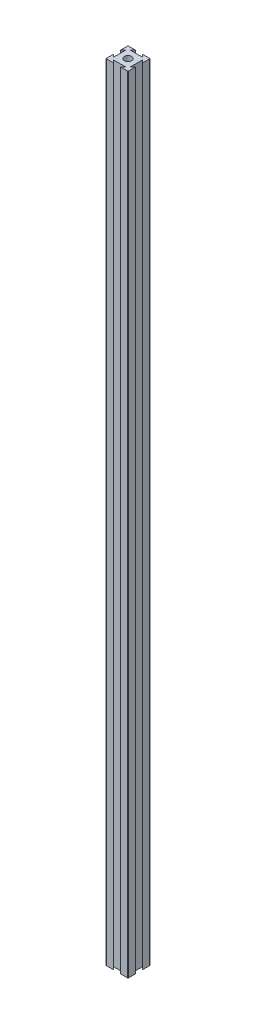
ISO-10303-21;
HEADER;
FILE_DESCRIPTION(('STEP AP214'),'2;1');
FILE_NAME('part.step','',(''),(''),'','','');
FILE_SCHEMA(('AUTOMOTIVE_DESIGN { 1 0 10303 214 1 1 1 1 }'));
ENDSEC;
DATA;
#1=APPLICATION_CONTEXT('core data for automotive mechanical design processes');
#2=APPLICATION_PROTOCOL_DEFINITION('international standard','automotive_design',2000,#1);
#3=PRODUCT_CONTEXT('',#1,'mechanical');
#4=PRODUCT('Part','Part','',(#3));
#5=PRODUCT_RELATED_PRODUCT_CATEGORY('part','',(#4));
#6=PRODUCT_DEFINITION_FORMATION('','',#4);
#7=PRODUCT_DEFINITION_CONTEXT('part definition',#1,'design');
#8=PRODUCT_DEFINITION('design','',#6,#7);
#9=PRODUCT_DEFINITION_SHAPE('','',#8);
#10=(LENGTH_UNIT() NAMED_UNIT(*) SI_UNIT(.MILLI.,.METRE.));
#11=(NAMED_UNIT(*) PLANE_ANGLE_UNIT() SI_UNIT($,.RADIAN.));
#12=(NAMED_UNIT(*) SI_UNIT($,.STERADIAN.) SOLID_ANGLE_UNIT());
#13=UNCERTAINTY_MEASURE_WITH_UNIT(LENGTH_MEASURE(1.E-05),#10,'distance_accuracy_value','');
#14=(GEOMETRIC_REPRESENTATION_CONTEXT(3) GLOBAL_UNCERTAINTY_ASSIGNED_CONTEXT((#13)) GLOBAL_UNIT_ASSIGNED_CONTEXT((#10,
#11,#12)) REPRESENTATION_CONTEXT('',''));
#15=CARTESIAN_POINT('',(0.,0.,0.));
#16=DIRECTION('',(0.,0.,1.));
#17=DIRECTION('',(1.,0.,0.));
#18=AXIS2_PLACEMENT_3D('',#15,#16,#17);
#19=CARTESIAN_POINT('',(16.6666666666667,711.2,-16.6666666666667));
#20=DIRECTION('',(-0.707106781186547,0.,0.707106781186548));
#21=DIRECTION('',(0.707106781186548,0.,0.707106781186547));
#22=AXIS2_PLACEMENT_3D('',#19,#20,#21);
#23=PLANE('',#22);
#24=DIRECTION('',(-0.707106781186548,0.,-0.707106781186547));
#25=VECTOR('',#24,1.);
#26=CARTESIAN_POINT('',(16.6666666666667,0.,-16.6666666666667));
#27=LINE('',#26,#25);
#28=CARTESIAN_POINT('',(20.,0.,-13.3333333333333));
#29=VERTEX_POINT('',#28);
#30=CARTESIAN_POINT('',(17.6183333333333,0.,-15.715));
#31=VERTEX_POINT('',#30);
#32=EDGE_CURVE('E201',#29,#31,#27,.T.);
#33=ORIENTED_EDGE('',*,*,#32,.F.);
#34=DIRECTION('',(0.,-1.,0.));
#35=VECTOR('',#34,1.);
#36=CARTESIAN_POINT('',(20.,711.2,-13.3333333333333));
#37=LINE('',#36,#35);
#38=CARTESIAN_POINT('',(20.,711.2,-13.3333333333333));
#39=VERTEX_POINT('',#38);
#40=EDGE_CURVE('E195',#39,#29,#37,.T.);
#41=ORIENTED_EDGE('',*,*,#40,.F.);
#42=DIRECTION('',(-0.707106781186548,0.,-0.707106781186547));
#43=VECTOR('',#42,1.);
#44=CARTESIAN_POINT('',(16.6666666666667,711.2,-16.6666666666667));
#45=LINE('',#44,#43);
#46=CARTESIAN_POINT('',(17.6183333333333,711.2,-15.715));
#47=VERTEX_POINT('',#46);
#48=EDGE_CURVE('E198',#39,#47,#45,.T.);
#49=ORIENTED_EDGE('',*,*,#48,.T.);
#50=DIRECTION('',(0.,-1.,0.));
#51=VECTOR('',#50,1.);
#52=CARTESIAN_POINT('',(17.6183333333333,711.2,-15.715));
#53=LINE('',#52,#51);
#54=EDGE_CURVE('E269',#47,#31,#53,.T.);
#55=ORIENTED_EDGE('',*,*,#54,.T.);
#56=EDGE_LOOP('',(#33,#41,#49,#55));
#57=FACE_BOUND('',#56,.T.);
#58=ADVANCED_FACE('F35',(#57),#23,.T.);
#59=CARTESIAN_POINT('',(20.,711.2,0.));
#60=DIRECTION('',(-1.,0.,0.));
#61=DIRECTION('',(0.,0.,1.));
#62=AXIS2_PLACEMENT_3D('',#59,#60,#61);
#63=PLANE('',#62);
#64=DIRECTION('',(0.,0.,-1.));
#65=VECTOR('',#64,1.);
#66=CARTESIAN_POINT('',(20.,0.,0.));
#67=LINE('',#66,#65);
#68=CARTESIAN_POINT('',(20.,0.,-19.492));
#69=VERTEX_POINT('',#68);
#70=EDGE_CURVE('E274',#29,#69,#67,.T.);
#71=ORIENTED_EDGE('',*,*,#70,.T.);
#72=DIRECTION('',(0.,-1.,0.));
#73=VECTOR('',#72,1.);
#74=CARTESIAN_POINT('',(20.,711.2,-19.492));
#75=LINE('',#74,#73);
#76=CARTESIAN_POINT('',(20.,711.2,-19.492));
#77=VERTEX_POINT('',#76);
#78=EDGE_CURVE('E212',#69,#77,#75,.F.);
#79=ORIENTED_EDGE('',*,*,#78,.T.);
#80=DIRECTION('',(0.,0.,-1.));
#81=VECTOR('',#80,1.);
#82=CARTESIAN_POINT('',(20.,711.2,0.));
#83=LINE('',#82,#81);
#84=EDGE_CURVE('E209',#39,#77,#83,.T.);
#85=ORIENTED_EDGE('',*,*,#84,.F.);
#86=ORIENTED_EDGE('',*,*,#40,.T.);
#87=EDGE_LOOP('',(#71,#79,#85,#86));
#88=FACE_BOUND('',#87,.T.);
#89=ADVANCED_FACE('F210',(#88),#63,.F.);
#90=CARTESIAN_POINT('',(0.,711.2,-20.));
#91=DIRECTION('',(0.,0.,-1.));
#92=DIRECTION('',(-1.,0.,0.));
#93=AXIS2_PLACEMENT_3D('',#90,#91,#92);
#94=PLANE('',#93);
#95=DIRECTION('',(1.,0.,0.));
#96=VECTOR('',#95,1.);
#97=CARTESIAN_POINT('',(0.,711.2,-20.));
#98=LINE('',#97,#96);
#99=CARTESIAN_POINT('',(13.3333333333333,711.2,-20.));
#100=VERTEX_POINT('',#99);
#101=CARTESIAN_POINT('',(19.492,711.2,-20.));
#102=VERTEX_POINT('',#101);
#103=EDGE_CURVE('E214',#100,#102,#98,.T.);
#104=ORIENTED_EDGE('',*,*,#103,.T.);
#105=DIRECTION('',(0.,-1.,0.));
#106=VECTOR('',#105,1.);
#107=CARTESIAN_POINT('',(19.492,0.,-20.));
#108=LINE('',#107,#106);
#109=CARTESIAN_POINT('',(19.492,0.,-20.));
#110=VERTEX_POINT('',#109);
#111=EDGE_CURVE('E376',#102,#110,#108,.T.);
#112=ORIENTED_EDGE('',*,*,#111,.T.);
#113=DIRECTION('',(1.,0.,0.));
#114=VECTOR('',#113,1.);
#115=CARTESIAN_POINT('',(0.,0.,-20.));
#116=LINE('',#115,#114);
#117=CARTESIAN_POINT('',(13.3333333333333,0.,-20.));
#118=VERTEX_POINT('',#117);
#119=EDGE_CURVE('E276',#118,#110,#116,.T.);
#120=ORIENTED_EDGE('',*,*,#119,.F.);
#121=DIRECTION('',(0.,-1.,0.));
#122=VECTOR('',#121,1.);
#123=CARTESIAN_POINT('',(13.3333333333333,711.2,-20.));
#124=LINE('',#123,#122);
#125=EDGE_CURVE('E206',#100,#118,#124,.T.);
#126=ORIENTED_EDGE('',*,*,#125,.F.);
#127=EDGE_LOOP('',(#104,#112,#120,#126));
#128=FACE_BOUND('',#127,.T.);
#129=ADVANCED_FACE('F408',(#128),#94,.T.);
#130=CARTESIAN_POINT('',(16.6666666666666,711.2,-16.6666666666668));
#131=DIRECTION('',(-0.707106781186544,0.,0.707106781186551));
#132=DIRECTION('',(0.707106781186551,0.,0.707106781186544));
#133=AXIS2_PLACEMENT_3D('',#130,#131,#132);
#134=PLANE('',#133);
#135=DIRECTION('',(-0.707106781186551,0.,-0.707106781186544));
#136=VECTOR('',#135,1.);
#137=CARTESIAN_POINT('',(16.6666666666666,0.,-16.6666666666668));
#138=LINE('',#137,#136);
#139=CARTESIAN_POINT('',(15.715,0.,-17.6183333333334));
#140=VERTEX_POINT('',#139);
#141=EDGE_CURVE('E280',#140,#118,#138,.T.);
#142=ORIENTED_EDGE('',*,*,#141,.F.);
#143=DIRECTION('',(0.,-1.,0.));
#144=VECTOR('',#143,1.);
#145=CARTESIAN_POINT('',(15.715,711.2,-17.6183333333334));
#146=LINE('',#145,#144);
#147=CARTESIAN_POINT('',(15.715,711.2,-17.6183333333334));
#148=VERTEX_POINT('',#147);
#149=EDGE_CURVE('E354',#148,#140,#146,.T.);
#150=ORIENTED_EDGE('',*,*,#149,.F.);
#151=DIRECTION('',(-0.707106781186551,0.,-0.707106781186544));
#152=VECTOR('',#151,1.);
#153=CARTESIAN_POINT('',(16.6666666666666,711.2,-16.6666666666668));
#154=LINE('',#153,#152);
#155=EDGE_CURVE('E230',#148,#100,#154,.T.);
#156=ORIENTED_EDGE('',*,*,#155,.T.);
#157=ORIENTED_EDGE('',*,*,#125,.T.);
#158=EDGE_LOOP('',(#142,#150,#156,#157));
#159=FACE_BOUND('',#158,.T.);
#160=ADVANCED_FACE('F412',(#159),#134,.T.);
#161=CARTESIAN_POINT('',(0.,711.2,-17.6183333333334));
#162=DIRECTION('',(0.,0.,-1.));
#163=DIRECTION('',(-1.,0.,0.));
#164=AXIS2_PLACEMENT_3D('',#161,#162,#163);
#165=PLANE('',#164);
#166=DIRECTION('',(1.,0.,0.));
#167=VECTOR('',#166,1.);
#168=CARTESIAN_POINT('',(0.,0.,-17.6183333333334));
#169=LINE('',#168,#167);
#170=CARTESIAN_POINT('',(4.285,0.,-17.6183333333334));
#171=VERTEX_POINT('',#170);
#172=EDGE_CURVE('E284',#171,#140,#169,.T.);
#173=ORIENTED_EDGE('',*,*,#172,.F.);
#174=DIRECTION('',(0.,-1.,0.));
#175=VECTOR('',#174,1.);
#176=CARTESIAN_POINT('',(4.285,711.2,-17.6183333333334));
#177=LINE('',#176,#175);
#178=CARTESIAN_POINT('',(4.285,711.2,-17.6183333333334));
#179=VERTEX_POINT('',#178);
#180=EDGE_CURVE('E352',#179,#171,#177,.T.);
#181=ORIENTED_EDGE('',*,*,#180,.F.);
#182=DIRECTION('',(1.,0.,0.));
#183=VECTOR('',#182,1.);
#184=CARTESIAN_POINT('',(0.,711.2,-17.6183333333334));
#185=LINE('',#184,#183);
#186=EDGE_CURVE('E234',#179,#148,#185,.T.);
#187=ORIENTED_EDGE('',*,*,#186,.T.);
#188=ORIENTED_EDGE('',*,*,#149,.T.);
#189=EDGE_LOOP('',(#173,#181,#187,#188));
#190=FACE_BOUND('',#189,.T.);
#191=ADVANCED_FACE('F439',(#190),#165,.T.);
#192=CARTESIAN_POINT('',(-6.6666666666667,711.2,-6.66666666666677));
#193=DIRECTION('',(0.707106781186544,0.,0.707106781186551));
#194=DIRECTION('',(0.707106781186551,0.,-0.707106781186544));
#195=AXIS2_PLACEMENT_3D('',#192,#193,#194);
#196=PLANE('',#195);
#197=DIRECTION('',(-0.707106781186551,0.,0.707106781186544));
#198=VECTOR('',#197,1.);
#199=CARTESIAN_POINT('',(-6.6666666666667,0.,-6.66666666666677));
#200=LINE('',#199,#198);
#201=CARTESIAN_POINT('',(6.66666666666666,0.,-20.));
#202=VERTEX_POINT('',#201);
#203=EDGE_CURVE('E287',#202,#171,#200,.T.);
#204=ORIENTED_EDGE('',*,*,#203,.F.);
#205=DIRECTION('',(0.,-1.,0.));
#206=VECTOR('',#205,1.);
#207=CARTESIAN_POINT('',(6.66666666666666,711.2,-20.));
#208=LINE('',#207,#206);
#209=CARTESIAN_POINT('',(6.66666666666666,711.2,-20.));
#210=VERTEX_POINT('',#209);
#211=EDGE_CURVE('E349',#210,#202,#208,.T.);
#212=ORIENTED_EDGE('',*,*,#211,.F.);
#213=DIRECTION('',(-0.707106781186551,0.,0.707106781186544));
#214=VECTOR('',#213,1.);
#215=CARTESIAN_POINT('',(-6.6666666666667,711.2,-6.66666666666677));
#216=LINE('',#215,#214);
#217=EDGE_CURVE('E237',#210,#179,#216,.T.);
#218=ORIENTED_EDGE('',*,*,#217,.T.);
#219=ORIENTED_EDGE('',*,*,#180,.T.);
#220=EDGE_LOOP('',(#204,#212,#218,#219));
#221=FACE_BOUND('',#220,.T.);
#222=ADVANCED_FACE('F442',(#221),#196,.T.);
#223=CARTESIAN_POINT('',(0.508,0.,-20.));
#224=VERTEX_POINT('',#223);
#225=EDGE_CURVE('E281',#224,#202,#116,.T.);
#226=ORIENTED_EDGE('',*,*,#225,.F.);
#227=DIRECTION('',(0.,-1.,0.));
#228=VECTOR('',#227,1.);
#229=CARTESIAN_POINT('',(0.508,711.2,-20.));
#230=LINE('',#229,#228);
#231=CARTESIAN_POINT('',(0.508,711.2,-20.));
#232=VERTEX_POINT('',#231);
#233=EDGE_CURVE('E367',#224,#232,#230,.F.);
#234=ORIENTED_EDGE('',*,*,#233,.T.);
#235=EDGE_CURVE('E231',#232,#210,#98,.T.);
#236=ORIENTED_EDGE('',*,*,#235,.T.);
#237=ORIENTED_EDGE('',*,*,#211,.T.);
#238=EDGE_LOOP('',(#226,#234,#236,#237));
#239=FACE_BOUND('',#238,.T.);
#240=ADVANCED_FACE('F505',(#239),#94,.T.);
#241=CARTESIAN_POINT('',(0.,711.2,0.));
#242=DIRECTION('',(-1.,0.,0.));
#243=DIRECTION('',(0.,0.,1.));
#244=AXIS2_PLACEMENT_3D('',#241,#242,#243);
#245=PLANE('',#244);
#246=DIRECTION('',(0.,0.,-1.));
#247=VECTOR('',#246,1.);
#248=CARTESIAN_POINT('',(0.,711.2,0.));
#249=LINE('',#248,#247);
#250=CARTESIAN_POINT('',(0.,711.2,-13.3333333333333));
#251=VERTEX_POINT('',#250);
#252=CARTESIAN_POINT('',(0.,711.2,-19.492));
#253=VERTEX_POINT('',#252);
#254=EDGE_CURVE('E240',#251,#253,#249,.T.);
#255=ORIENTED_EDGE('',*,*,#254,.T.);
#256=DIRECTION('',(0.,-1.,0.));
#257=VECTOR('',#256,1.);
#258=CARTESIAN_POINT('',(0.,711.2,-19.492));
#259=LINE('',#258,#257);
#260=CARTESIAN_POINT('',(0.,0.,-19.492));
#261=VERTEX_POINT('',#260);
#262=EDGE_CURVE('E205',#253,#261,#259,.T.);
#263=ORIENTED_EDGE('',*,*,#262,.T.);
#264=DIRECTION('',(0.,0.,-1.));
#265=VECTOR('',#264,1.);
#266=CARTESIAN_POINT('',(0.,0.,0.));
#267=LINE('',#266,#265);
#268=CARTESIAN_POINT('',(0.,0.,-13.3333333333333));
#269=VERTEX_POINT('',#268);
#270=EDGE_CURVE('E290',#269,#261,#267,.T.);
#271=ORIENTED_EDGE('',*,*,#270,.F.);
#272=DIRECTION('',(0.,-1.,0.));
#273=VECTOR('',#272,1.);
#274=CARTESIAN_POINT('',(0.,711.2,-13.3333333333333));
#275=LINE('',#274,#273);
#276=EDGE_CURVE('E347',#251,#269,#275,.T.);
#277=ORIENTED_EDGE('',*,*,#276,.F.);
#278=EDGE_LOOP('',(#255,#263,#271,#277));
#279=FACE_BOUND('',#278,.T.);
#280=ADVANCED_FACE('F451',(#279),#245,.T.);
#281=CARTESIAN_POINT('',(-6.66666666666667,711.2,-6.66666666666669));
#282=DIRECTION('',(-0.707106781186546,0.,-0.707106781186548));
#283=DIRECTION('',(-0.707106781186549,0.,0.707106781186547));
#284=AXIS2_PLACEMENT_3D('',#281,#282,#283);
#285=PLANE('',#284);
#286=DIRECTION('',(0.707106781186549,0.,-0.707106781186547));
#287=VECTOR('',#286,1.);
#288=CARTESIAN_POINT('',(-6.66666666666667,0.,-6.66666666666669));
#289=LINE('',#288,#287);
#290=CARTESIAN_POINT('',(2.38166666666667,0.,-15.715));
#291=VERTEX_POINT('',#290);
#292=EDGE_CURVE('E293',#269,#291,#289,.T.);
#293=ORIENTED_EDGE('',*,*,#292,.T.);
#294=DIRECTION('',(0.,-1.,0.));
#295=VECTOR('',#294,1.);
#296=CARTESIAN_POINT('',(2.38166666666667,711.2,-15.715));
#297=LINE('',#296,#295);
#298=CARTESIAN_POINT('',(2.38166666666667,711.2,-15.715));
#299=VERTEX_POINT('',#298);
#300=EDGE_CURVE('E344',#299,#291,#297,.T.);
#301=ORIENTED_EDGE('',*,*,#300,.F.);
#302=DIRECTION('',(0.707106781186549,0.,-0.707106781186547));
#303=VECTOR('',#302,1.);
#304=CARTESIAN_POINT('',(-6.66666666666667,711.2,-6.66666666666669));
#305=LINE('',#304,#303);
#306=EDGE_CURVE('E243',#251,#299,#305,.T.);
#307=ORIENTED_EDGE('',*,*,#306,.F.);
#308=ORIENTED_EDGE('',*,*,#276,.T.);
#309=EDGE_LOOP('',(#293,#301,#307,#308));
#310=FACE_BOUND('',#309,.T.);
#311=ADVANCED_FACE('F456',(#310),#285,.F.);
#312=CARTESIAN_POINT('',(2.38166666666667,711.2,0.));
#313=DIRECTION('',(1.,0.,0.));
#314=DIRECTION('',(0.,0.,-1.));
#315=AXIS2_PLACEMENT_3D('',#312,#313,#314);
#316=PLANE('',#315);
#317=DIRECTION('',(0.,0.,1.));
#318=VECTOR('',#317,1.);
#319=CARTESIAN_POINT('',(2.38166666666667,0.,0.));
#320=LINE('',#319,#318);
#321=CARTESIAN_POINT('',(2.38166666666667,0.,-4.285));
#322=VERTEX_POINT('',#321);
#323=EDGE_CURVE('E297',#291,#322,#320,.T.);
#324=ORIENTED_EDGE('',*,*,#323,.T.);
#325=DIRECTION('',(0.,-1.,0.));
#326=VECTOR('',#325,1.);
#327=CARTESIAN_POINT('',(2.38166666666667,711.2,-4.285));
#328=LINE('',#327,#326);
#329=CARTESIAN_POINT('',(2.38166666666667,711.2,-4.285));
#330=VERTEX_POINT('',#329);
#331=EDGE_CURVE('E341',#330,#322,#328,.T.);
#332=ORIENTED_EDGE('',*,*,#331,.F.);
#333=DIRECTION('',(0.,0.,1.));
#334=VECTOR('',#333,1.);
#335=CARTESIAN_POINT('',(2.38166666666667,711.2,0.));
#336=LINE('',#335,#334);
#337=EDGE_CURVE('E247',#299,#330,#336,.T.);
#338=ORIENTED_EDGE('',*,*,#337,.F.);
#339=ORIENTED_EDGE('',*,*,#300,.T.);
#340=EDGE_LOOP('',(#324,#332,#338,#339));
#341=FACE_BOUND('',#340,.T.);
#342=ADVANCED_FACE('F462',(#341),#316,.F.);
#343=CARTESIAN_POINT('',(3.33333333333333,711.2,-3.33333333333335));
#344=DIRECTION('',(-0.707106781186546,0.,0.707106781186549));
#345=DIRECTION('',(0.707106781186549,0.,0.707106781186546));
#346=AXIS2_PLACEMENT_3D('',#343,#344,#345);
#347=PLANE('',#346);
#348=DIRECTION('',(-0.707106781186549,0.,-0.707106781186546));
#349=VECTOR('',#348,1.);
#350=CARTESIAN_POINT('',(3.33333333333333,0.,-3.33333333333335));
#351=LINE('',#350,#349);
#352=CARTESIAN_POINT('',(0.,0.,-6.66666666666667));
#353=VERTEX_POINT('',#352);
#354=EDGE_CURVE('E300',#322,#353,#351,.T.);
#355=ORIENTED_EDGE('',*,*,#354,.T.);
#356=DIRECTION('',(0.,-1.,0.));
#357=VECTOR('',#356,1.);
#358=CARTESIAN_POINT('',(0.,711.2,-6.66666666666667));
#359=LINE('',#358,#357);
#360=CARTESIAN_POINT('',(0.,711.2,-6.66666666666667));
#361=VERTEX_POINT('',#360);
#362=EDGE_CURVE('E338',#361,#353,#359,.T.);
#363=ORIENTED_EDGE('',*,*,#362,.F.);
#364=DIRECTION('',(-0.707106781186549,0.,-0.707106781186546));
#365=VECTOR('',#364,1.);
#366=CARTESIAN_POINT('',(3.33333333333333,711.2,-3.33333333333335));
#367=LINE('',#366,#365);
#368=EDGE_CURVE('E250',#330,#361,#367,.T.);
#369=ORIENTED_EDGE('',*,*,#368,.F.);
#370=ORIENTED_EDGE('',*,*,#331,.T.);
#371=EDGE_LOOP('',(#355,#363,#369,#370));
#372=FACE_BOUND('',#371,.T.);
#373=ADVANCED_FACE('F464',(#372),#347,.F.);
#374=CARTESIAN_POINT('',(0.,0.,-0.508));
#375=VERTEX_POINT('',#374);
#376=EDGE_CURVE('E294',#375,#353,#267,.T.);
#377=ORIENTED_EDGE('',*,*,#376,.F.);
#378=DIRECTION('',(0.,-1.,0.));
#379=VECTOR('',#378,1.);
#380=CARTESIAN_POINT('',(0.,711.2,-0.508));
#381=LINE('',#380,#379);
#382=CARTESIAN_POINT('',(0.,711.2,-0.508));
#383=VERTEX_POINT('',#382);
#384=EDGE_CURVE('E383',#375,#383,#381,.F.);
#385=ORIENTED_EDGE('',*,*,#384,.T.);
#386=EDGE_CURVE('E244',#383,#361,#249,.T.);
#387=ORIENTED_EDGE('',*,*,#386,.T.);
#388=ORIENTED_EDGE('',*,*,#362,.T.);
#389=EDGE_LOOP('',(#377,#385,#387,#388));
#390=FACE_BOUND('',#389,.T.);
#391=ADVANCED_FACE('F467',(#390),#245,.T.);
#392=CARTESIAN_POINT('',(0.,711.2,0.));
#393=DIRECTION('',(0.,0.,-1.));
#394=DIRECTION('',(-1.,0.,0.));
#395=AXIS2_PLACEMENT_3D('',#392,#393,#394);
#396=PLANE('',#395);
#397=DIRECTION('',(1.,0.,0.));
#398=VECTOR('',#397,1.);
#399=CARTESIAN_POINT('',(0.,711.2,0.));
#400=LINE('',#399,#398);
#401=CARTESIAN_POINT('',(0.508,711.2,0.));
#402=VERTEX_POINT('',#401);
#403=CARTESIAN_POINT('',(6.66666666666667,711.2,0.));
#404=VERTEX_POINT('',#403);
#405=EDGE_CURVE('E253',#402,#404,#400,.T.);
#406=ORIENTED_EDGE('',*,*,#405,.F.);
#407=DIRECTION('',(0.,-1.,0.));
#408=VECTOR('',#407,1.);
#409=CARTESIAN_POINT('',(0.508,0.,0.));
#410=LINE('',#409,#408);
#411=CARTESIAN_POINT('',(0.508,0.,0.));
#412=VERTEX_POINT('',#411);
#413=EDGE_CURVE('E380',#402,#412,#410,.T.);
#414=ORIENTED_EDGE('',*,*,#413,.T.);
#415=DIRECTION('',(1.,0.,0.));
#416=VECTOR('',#415,1.);
#417=CARTESIAN_POINT('',(0.,0.,0.));
#418=LINE('',#417,#416);
#419=CARTESIAN_POINT('',(6.66666666666667,0.,0.));
#420=VERTEX_POINT('',#419);
#421=EDGE_CURVE('E303',#412,#420,#418,.T.);
#422=ORIENTED_EDGE('',*,*,#421,.T.);
#423=DIRECTION('',(0.,-1.,0.));
#424=VECTOR('',#423,1.);
#425=CARTESIAN_POINT('',(6.66666666666667,711.2,0.));
#426=LINE('',#425,#424);
#427=EDGE_CURVE('E335',#404,#420,#426,.T.);
#428=ORIENTED_EDGE('',*,*,#427,.F.);
#429=EDGE_LOOP('',(#406,#414,#422,#428));
#430=FACE_BOUND('',#429,.T.);
#431=ADVANCED_FACE('F474',(#430),#396,.F.);
#432=CARTESIAN_POINT('',(3.3333333333333,711.2,-3.33333333333333));
#433=DIRECTION('',(-0.707106781186544,0.,0.707106781186551));
#434=DIRECTION('',(0.707106781186551,0.,0.707106781186544));
#435=AXIS2_PLACEMENT_3D('',#432,#433,#434);
#436=PLANE('',#435);
#437=DIRECTION('',(-0.707106781186551,0.,-0.707106781186544));
#438=VECTOR('',#437,1.);
#439=CARTESIAN_POINT('',(3.3333333333333,0.,-3.33333333333333));
#440=LINE('',#439,#438);
#441=CARTESIAN_POINT('',(4.285,0.,-2.38166666666664));
#442=VERTEX_POINT('',#441);
#443=EDGE_CURVE('E305',#420,#442,#440,.T.);
#444=ORIENTED_EDGE('',*,*,#443,.T.);
#445=DIRECTION('',(0.,-1.,0.));
#446=VECTOR('',#445,1.);
#447=CARTESIAN_POINT('',(4.285,711.2,-2.38166666666664));
#448=LINE('',#447,#446);
#449=CARTESIAN_POINT('',(4.285,711.2,-2.38166666666664));
#450=VERTEX_POINT('',#449);
#451=EDGE_CURVE('E332',#450,#442,#448,.T.);
#452=ORIENTED_EDGE('',*,*,#451,.F.);
#453=DIRECTION('',(-0.707106781186551,0.,-0.707106781186544));
#454=VECTOR('',#453,1.);
#455=CARTESIAN_POINT('',(3.3333333333333,711.2,-3.33333333333333));
#456=LINE('',#455,#454);
#457=EDGE_CURVE('E255',#404,#450,#456,.T.);
#458=ORIENTED_EDGE('',*,*,#457,.F.);
#459=ORIENTED_EDGE('',*,*,#427,.T.);
#460=EDGE_LOOP('',(#444,#452,#458,#459));
#461=FACE_BOUND('',#460,.T.);
#462=ADVANCED_FACE('F480',(#461),#436,.F.);
#463=CARTESIAN_POINT('',(0.,711.2,-2.38166666666664));
#464=DIRECTION('',(0.,0.,-1.));
#465=DIRECTION('',(-1.,0.,0.));
#466=AXIS2_PLACEMENT_3D('',#463,#464,#465);
#467=PLANE('',#466);
#468=DIRECTION('',(1.,0.,0.));
#469=VECTOR('',#468,1.);
#470=CARTESIAN_POINT('',(0.,0.,-2.38166666666664));
#471=LINE('',#470,#469);
#472=CARTESIAN_POINT('',(15.715,0.,-2.38166666666664));
#473=VERTEX_POINT('',#472);
#474=EDGE_CURVE('E309',#442,#473,#471,.T.);
#475=ORIENTED_EDGE('',*,*,#474,.T.);
#476=DIRECTION('',(0.,-1.,0.));
#477=VECTOR('',#476,1.);
#478=CARTESIAN_POINT('',(15.715,711.2,-2.38166666666664));
#479=LINE('',#478,#477);
#480=CARTESIAN_POINT('',(15.715,711.2,-2.38166666666664));
#481=VERTEX_POINT('',#480);
#482=EDGE_CURVE('E329',#481,#473,#479,.T.);
#483=ORIENTED_EDGE('',*,*,#482,.F.);
#484=DIRECTION('',(1.,0.,0.));
#485=VECTOR('',#484,1.);
#486=CARTESIAN_POINT('',(0.,711.2,-2.38166666666664));
#487=LINE('',#486,#485);
#488=EDGE_CURVE('E259',#450,#481,#487,.T.);
#489=ORIENTED_EDGE('',*,*,#488,.F.);
#490=ORIENTED_EDGE('',*,*,#451,.T.);
#491=EDGE_LOOP('',(#475,#483,#489,#490));
#492=FACE_BOUND('',#491,.T.);
#493=ADVANCED_FACE('F483',(#492),#467,.F.);
#494=CARTESIAN_POINT('',(6.66666666666659,711.2,6.66666666666667));
#495=DIRECTION('',(0.707106781186544,0.,0.707106781186551));
#496=DIRECTION('',(0.707106781186551,0.,-0.707106781186544));
#497=AXIS2_PLACEMENT_3D('',#494,#495,#496);
#498=PLANE('',#497);
#499=DIRECTION('',(-0.707106781186551,0.,0.707106781186544));
#500=VECTOR('',#499,1.);
#501=CARTESIAN_POINT('',(6.66666666666659,0.,6.66666666666667));
#502=LINE('',#501,#500);
#503=CARTESIAN_POINT('',(13.3333333333333,0.,0.));
#504=VERTEX_POINT('',#503);
#505=EDGE_CURVE('E312',#473,#504,#502,.T.);
#506=ORIENTED_EDGE('',*,*,#505,.T.);
#507=DIRECTION('',(0.,-1.,0.));
#508=VECTOR('',#507,1.);
#509=CARTESIAN_POINT('',(13.3333333333333,711.2,0.));
#510=LINE('',#509,#508);
#511=CARTESIAN_POINT('',(13.3333333333333,711.2,0.));
#512=VERTEX_POINT('',#511);
#513=EDGE_CURVE('E326',#512,#504,#510,.T.);
#514=ORIENTED_EDGE('',*,*,#513,.F.);
#515=DIRECTION('',(-0.707106781186551,0.,0.707106781186544));
#516=VECTOR('',#515,1.);
#517=CARTESIAN_POINT('',(6.66666666666659,711.2,6.66666666666667));
#518=LINE('',#517,#516);
#519=EDGE_CURVE('E262',#481,#512,#518,.T.);
#520=ORIENTED_EDGE('',*,*,#519,.F.);
#521=ORIENTED_EDGE('',*,*,#482,.T.);
#522=EDGE_LOOP('',(#506,#514,#520,#521));
#523=FACE_BOUND('',#522,.T.);
#524=ADVANCED_FACE('F485',(#523),#498,.F.);
#525=CARTESIAN_POINT('',(19.492,0.,0.));
#526=VERTEX_POINT('',#525);
#527=EDGE_CURVE('E306',#504,#526,#418,.T.);
#528=ORIENTED_EDGE('',*,*,#527,.T.);
#529=DIRECTION('',(0.,-1.,0.));
#530=VECTOR('',#529,1.);
#531=CARTESIAN_POINT('',(19.492,711.2,0.));
#532=LINE('',#531,#530);
#533=CARTESIAN_POINT('',(19.492,711.2,0.));
#534=VERTEX_POINT('',#533);
#535=EDGE_CURVE('E11',#526,#534,#532,.F.);
#536=ORIENTED_EDGE('',*,*,#535,.T.);
#537=EDGE_CURVE('E256',#512,#534,#400,.T.);
#538=ORIENTED_EDGE('',*,*,#537,.F.);
#539=ORIENTED_EDGE('',*,*,#513,.T.);
#540=EDGE_LOOP('',(#528,#536,#538,#539));
#541=FACE_BOUND('',#540,.T.);
#542=ADVANCED_FACE('F394',(#541),#396,.F.);
#543=CARTESIAN_POINT('',(20.,711.2,-0.508));
#544=VERTEX_POINT('',#543);
#545=CARTESIAN_POINT('',(20.,711.2,-6.66666666666667));
#546=VERTEX_POINT('',#545);
#547=EDGE_CURVE('E216',#544,#546,#83,.T.);
#548=ORIENTED_EDGE('',*,*,#547,.F.);
#549=DIRECTION('',(0.,-1.,0.));
#550=VECTOR('',#549,1.);
#551=CARTESIAN_POINT('',(20.,711.2,-0.508));
#552=LINE('',#551,#550);
#553=CARTESIAN_POINT('',(20.,0.,-0.508));
#554=VERTEX_POINT('',#553);
#555=EDGE_CURVE('E43',#544,#554,#552,.T.);
#556=ORIENTED_EDGE('',*,*,#555,.T.);
#557=CARTESIAN_POINT('',(20.,0.,-6.66666666666667));
#558=VERTEX_POINT('',#557);
#559=EDGE_CURVE('E277',#554,#558,#67,.T.);
#560=ORIENTED_EDGE('',*,*,#559,.T.);
#561=DIRECTION('',(0.,-1.,0.));
#562=VECTOR('',#561,1.);
#563=CARTESIAN_POINT('',(20.,711.2,-6.66666666666667));
#564=LINE('',#563,#562);
#565=EDGE_CURVE('E323',#546,#558,#564,.T.);
#566=ORIENTED_EDGE('',*,*,#565,.F.);
#567=EDGE_LOOP('',(#548,#556,#560,#566));
#568=FACE_BOUND('',#567,.T.);
#569=ADVANCED_FACE('F388',(#568),#63,.F.);
#570=CARTESIAN_POINT('',(6.66666666666663,711.2,6.66666666666666));
#571=DIRECTION('',(-0.707106781186546,0.,-0.707106781186549));
#572=DIRECTION('',(-0.707106781186549,0.,0.707106781186546));
#573=AXIS2_PLACEMENT_3D('',#570,#571,#572);
#574=PLANE('',#573);
#575=DIRECTION('',(0.707106781186549,0.,-0.707106781186546));
#576=VECTOR('',#575,1.);
#577=CARTESIAN_POINT('',(6.66666666666663,0.,6.66666666666666));
#578=LINE('',#577,#576);
#579=CARTESIAN_POINT('',(17.6183333333333,0.,-4.285));
#580=VERTEX_POINT('',#579);
#581=EDGE_CURVE('E315',#580,#558,#578,.T.);
#582=ORIENTED_EDGE('',*,*,#581,.F.);
#583=DIRECTION('',(0.,-1.,0.));
#584=VECTOR('',#583,1.);
#585=CARTESIAN_POINT('',(17.6183333333333,711.2,-4.285));
#586=LINE('',#585,#584);
#587=CARTESIAN_POINT('',(17.6183333333333,711.2,-4.285));
#588=VERTEX_POINT('',#587);
#589=EDGE_CURVE('E321',#588,#580,#586,.T.);
#590=ORIENTED_EDGE('',*,*,#589,.F.);
#591=DIRECTION('',(0.707106781186549,0.,-0.707106781186546));
#592=VECTOR('',#591,1.);
#593=CARTESIAN_POINT('',(6.66666666666663,711.2,6.66666666666666));
#594=LINE('',#593,#592);
#595=EDGE_CURVE('E265',#588,#546,#594,.T.);
#596=ORIENTED_EDGE('',*,*,#595,.T.);
#597=ORIENTED_EDGE('',*,*,#565,.T.);
#598=EDGE_LOOP('',(#582,#590,#596,#597));
#599=FACE_BOUND('',#598,.T.);
#600=ADVANCED_FACE('F418',(#599),#574,.T.);
#601=CARTESIAN_POINT('',(10.,711.2,-10.));
#602=DIRECTION('',(0.,-1.,0.));
#603=DIRECTION('',(0.,0.,-1.));
#604=AXIS2_PLACEMENT_3D('',#601,#602,#603);
#605=CYLINDRICAL_SURFACE('',#604,3.33333333333333);
#606=CARTESIAN_POINT('',(10.,711.2,-10.));
#607=DIRECTION('',(0.,1.,0.));
#608=DIRECTION('',(0.,0.,1.));
#609=AXIS2_PLACEMENT_3D('',#606,#607,#608);
#610=CIRCLE('',#609,3.33333333333333);
#611=CARTESIAN_POINT('',(10.,711.2,-6.66666666666667));
#612=VERTEX_POINT('',#611);
#613=EDGE_CURVE('E222',#612,#612,#610,.T.);
#614=ORIENTED_EDGE('',*,*,#613,.T.);
#615=EDGE_LOOP('',(#614));
#616=FACE_BOUND('',#615,.T.);
#617=CARTESIAN_POINT('',(10.,0.,-10.));
#618=DIRECTION('',(0.,1.,0.));
#619=DIRECTION('',(0.,0.,1.));
#620=AXIS2_PLACEMENT_3D('',#617,#618,#619);
#621=CIRCLE('',#620,3.33333333333333);
#622=CARTESIAN_POINT('',(10.,0.,-6.66666666666667));
#623=VERTEX_POINT('',#622);
#624=EDGE_CURVE('E270',#623,#623,#621,.T.);
#625=ORIENTED_EDGE('',*,*,#624,.F.);
#626=EDGE_LOOP('',(#625));
#627=FACE_BOUND('',#626,.T.);
#628=ADVANCED_FACE('F414',(#616,#627),#605,.F.);
#629=CARTESIAN_POINT('',(17.6183333333333,711.2,0.));
#630=DIRECTION('',(1.,0.,0.));
#631=DIRECTION('',(0.,0.,-1.));
#632=AXIS2_PLACEMENT_3D('',#629,#630,#631);
#633=PLANE('',#632);
#634=DIRECTION('',(0.,0.,1.));
#635=VECTOR('',#634,1.);
#636=CARTESIAN_POINT('',(17.6183333333333,0.,0.));
#637=LINE('',#636,#635);
#638=EDGE_CURVE('E225',#31,#580,#637,.T.);
#639=ORIENTED_EDGE('',*,*,#638,.F.);
#640=ORIENTED_EDGE('',*,*,#54,.F.);
#641=DIRECTION('',(0.,0.,1.));
#642=VECTOR('',#641,1.);
#643=CARTESIAN_POINT('',(17.6183333333333,711.2,0.));
#644=LINE('',#643,#642);
#645=EDGE_CURVE('E221',#47,#588,#644,.T.);
#646=ORIENTED_EDGE('',*,*,#645,.T.);
#647=ORIENTED_EDGE('',*,*,#589,.T.);
#648=EDGE_LOOP('',(#639,#640,#646,#647));
#649=FACE_BOUND('',#648,.T.);
#650=ADVANCED_FACE('F417',(#649),#633,.T.);
#651=CARTESIAN_POINT('',(0.,711.2,0.));
#652=DIRECTION('',(0.,1.,0.));
#653=DIRECTION('',(0.,0.,1.));
#654=AXIS2_PLACEMENT_3D('',#651,#652,#653);
#655=PLANE('',#654);
#656=ORIENTED_EDGE('',*,*,#613,.F.);
#657=EDGE_LOOP('',(#656));
#658=FACE_BOUND('',#657,.T.);
#659=ORIENTED_EDGE('',*,*,#235,.F.);
#660=CARTESIAN_POINT('',(0.508,711.2,-19.492));
#661=DIRECTION('',(0.,1.,0.));
#662=DIRECTION('',(0.,0.,1.));
#663=AXIS2_PLACEMENT_3D('',#660,#661,#662);
#664=CIRCLE('',#663,0.508);
#665=EDGE_CURVE('E374',#232,#253,#664,.T.);
#666=ORIENTED_EDGE('',*,*,#665,.T.);
#667=ORIENTED_EDGE('',*,*,#254,.F.);
#668=ORIENTED_EDGE('',*,*,#306,.T.);
#669=ORIENTED_EDGE('',*,*,#337,.T.);
#670=ORIENTED_EDGE('',*,*,#368,.T.);
#671=ORIENTED_EDGE('',*,*,#386,.F.);
#672=CARTESIAN_POINT('',(0.508,711.2,-0.508));
#673=DIRECTION('',(0.,1.,0.));
#674=DIRECTION('',(0.,0.,1.));
#675=AXIS2_PLACEMENT_3D('',#672,#673,#674);
#676=CIRCLE('',#675,0.508);
#677=EDGE_CURVE('E370',#383,#402,#676,.T.);
#678=ORIENTED_EDGE('',*,*,#677,.T.);
#679=ORIENTED_EDGE('',*,*,#405,.T.);
#680=ORIENTED_EDGE('',*,*,#457,.T.);
#681=ORIENTED_EDGE('',*,*,#488,.T.);
#682=ORIENTED_EDGE('',*,*,#519,.T.);
#683=ORIENTED_EDGE('',*,*,#537,.T.);
#684=CARTESIAN_POINT('',(19.492,711.2,-0.508));
#685=DIRECTION('',(0.,1.,0.));
#686=DIRECTION('',(0.,0.,1.));
#687=AXIS2_PLACEMENT_3D('',#684,#685,#686);
#688=CIRCLE('',#687,0.508);
#689=EDGE_CURVE('E50',#534,#544,#688,.T.);
#690=ORIENTED_EDGE('',*,*,#689,.T.);
#691=ORIENTED_EDGE('',*,*,#547,.T.);
#692=ORIENTED_EDGE('',*,*,#595,.F.);
#693=ORIENTED_EDGE('',*,*,#645,.F.);
#694=ORIENTED_EDGE('',*,*,#48,.F.);
#695=ORIENTED_EDGE('',*,*,#84,.T.);
#696=CARTESIAN_POINT('',(19.492,711.2,-19.492));
#697=DIRECTION('',(0.,1.,0.));
#698=DIRECTION('',(0.,0.,1.));
#699=AXIS2_PLACEMENT_3D('',#696,#697,#698);
#700=CIRCLE('',#699,0.508);
#701=EDGE_CURVE('E372',#77,#102,#700,.T.);
#702=ORIENTED_EDGE('',*,*,#701,.T.);
#703=ORIENTED_EDGE('',*,*,#103,.F.);
#704=ORIENTED_EDGE('',*,*,#155,.F.);
#705=ORIENTED_EDGE('',*,*,#186,.F.);
#706=ORIENTED_EDGE('',*,*,#217,.F.);
#707=EDGE_LOOP('',(#659,#666,#667,#668,#669,#670,#671,#678,#679,#680,#681,#682,#683,#690,#691,
#692,#693,#694,#695,#702,#703,#704,#705,#706));
#708=FACE_BOUND('',#707,.T.);
#709=ADVANCED_FACE('F218',(#658,#708),#655,.T.);
#710=CARTESIAN_POINT('',(0.,0.,0.));
#711=DIRECTION('',(0.,1.,0.));
#712=DIRECTION('',(0.,0.,1.));
#713=AXIS2_PLACEMENT_3D('',#710,#711,#712);
#714=PLANE('',#713);
#715=ORIENTED_EDGE('',*,*,#624,.T.);
#716=EDGE_LOOP('',(#715));
#717=FACE_BOUND('',#716,.T.);
#718=ORIENTED_EDGE('',*,*,#270,.T.);
#719=CARTESIAN_POINT('',(0.508,0.,-19.492));
#720=DIRECTION('',(0.,1.,0.));
#721=DIRECTION('',(0.,0.,1.));
#722=AXIS2_PLACEMENT_3D('',#719,#720,#721);
#723=CIRCLE('',#722,0.508);
#724=EDGE_CURVE('E365',#261,#224,#723,.F.);
#725=ORIENTED_EDGE('',*,*,#724,.T.);
#726=ORIENTED_EDGE('',*,*,#225,.T.);
#727=ORIENTED_EDGE('',*,*,#203,.T.);
#728=ORIENTED_EDGE('',*,*,#172,.T.);
#729=ORIENTED_EDGE('',*,*,#141,.T.);
#730=ORIENTED_EDGE('',*,*,#119,.T.);
#731=CARTESIAN_POINT('',(19.492,0.,-19.492));
#732=DIRECTION('',(0.,1.,0.));
#733=DIRECTION('',(0.,0.,1.));
#734=AXIS2_PLACEMENT_3D('',#731,#732,#733);
#735=CIRCLE('',#734,0.508);
#736=EDGE_CURVE('E363',#110,#69,#735,.F.);
#737=ORIENTED_EDGE('',*,*,#736,.T.);
#738=ORIENTED_EDGE('',*,*,#70,.F.);
#739=ORIENTED_EDGE('',*,*,#32,.T.);
#740=ORIENTED_EDGE('',*,*,#638,.T.);
#741=ORIENTED_EDGE('',*,*,#581,.T.);
#742=ORIENTED_EDGE('',*,*,#559,.F.);
#743=CARTESIAN_POINT('',(19.492,0.,-0.508));
#744=DIRECTION('',(0.,1.,0.));
#745=DIRECTION('',(0.,0.,1.));
#746=AXIS2_PLACEMENT_3D('',#743,#744,#745);
#747=CIRCLE('',#746,0.508);
#748=EDGE_CURVE('E359',#554,#526,#747,.F.);
#749=ORIENTED_EDGE('',*,*,#748,.T.);
#750=ORIENTED_EDGE('',*,*,#527,.F.);
#751=ORIENTED_EDGE('',*,*,#505,.F.);
#752=ORIENTED_EDGE('',*,*,#474,.F.);
#753=ORIENTED_EDGE('',*,*,#443,.F.);
#754=ORIENTED_EDGE('',*,*,#421,.F.);
#755=CARTESIAN_POINT('',(0.508,0.,-0.508));
#756=DIRECTION('',(0.,1.,0.));
#757=DIRECTION('',(0.,0.,1.));
#758=AXIS2_PLACEMENT_3D('',#755,#756,#757);
#759=CIRCLE('',#758,0.508);
#760=EDGE_CURVE('E361',#412,#375,#759,.F.);
#761=ORIENTED_EDGE('',*,*,#760,.T.);
#762=ORIENTED_EDGE('',*,*,#376,.T.);
#763=ORIENTED_EDGE('',*,*,#354,.F.);
#764=ORIENTED_EDGE('',*,*,#323,.F.);
#765=ORIENTED_EDGE('',*,*,#292,.F.);
#766=EDGE_LOOP('',(#718,#725,#726,#727,#728,#729,#730,#737,#738,#739,#740,#741,#742,#749,#750,
#751,#752,#753,#754,#761,#762,#763,#764,#765));
#767=FACE_BOUND('',#766,.T.);
#768=ADVANCED_FACE('F392',(#717,#767),#714,.F.);
#769=CARTESIAN_POINT('',(0.508,711.2,-19.492));
#770=DIRECTION('',(0.,-1.,0.));
#771=DIRECTION('',(0.,0.,-1.));
#772=AXIS2_PLACEMENT_3D('',#769,#770,#771);
#773=CYLINDRICAL_SURFACE('',#772,0.508);
#774=ORIENTED_EDGE('',*,*,#665,.F.);
#775=ORIENTED_EDGE('',*,*,#233,.F.);
#776=ORIENTED_EDGE('',*,*,#724,.F.);
#777=ORIENTED_EDGE('',*,*,#262,.F.);
#778=EDGE_LOOP('',(#774,#775,#776,#777));
#779=FACE_BOUND('',#778,.T.);
#780=ADVANCED_FACE('F420',(#779),#773,.T.);
#781=CARTESIAN_POINT('',(19.492,711.2,-19.492));
#782=DIRECTION('',(0.,1.,0.));
#783=DIRECTION('',(0.,0.,1.));
#784=AXIS2_PLACEMENT_3D('',#781,#782,#783);
#785=CYLINDRICAL_SURFACE('',#784,0.508);
#786=ORIENTED_EDGE('',*,*,#701,.F.);
#787=ORIENTED_EDGE('',*,*,#78,.F.);
#788=ORIENTED_EDGE('',*,*,#736,.F.);
#789=ORIENTED_EDGE('',*,*,#111,.F.);
#790=EDGE_LOOP('',(#786,#787,#788,#789));
#791=FACE_BOUND('',#790,.T.);
#792=ADVANCED_FACE('F401',(#791),#785,.T.);
#793=CARTESIAN_POINT('',(0.508,711.2,-0.508));
#794=DIRECTION('',(0.,1.,0.));
#795=DIRECTION('',(0.,0.,1.));
#796=AXIS2_PLACEMENT_3D('',#793,#794,#795);
#797=CYLINDRICAL_SURFACE('',#796,0.508);
#798=ORIENTED_EDGE('',*,*,#677,.F.);
#799=ORIENTED_EDGE('',*,*,#384,.F.);
#800=ORIENTED_EDGE('',*,*,#760,.F.);
#801=ORIENTED_EDGE('',*,*,#413,.F.);
#802=EDGE_LOOP('',(#798,#799,#800,#801));
#803=FACE_BOUND('',#802,.T.);
#804=ADVANCED_FACE('F397',(#803),#797,.T.);
#805=CARTESIAN_POINT('',(19.492,711.2,-0.508));
#806=DIRECTION('',(0.,-1.,0.));
#807=DIRECTION('',(0.,0.,-1.));
#808=AXIS2_PLACEMENT_3D('',#805,#806,#807);
#809=CYLINDRICAL_SURFACE('',#808,0.508);
#810=ORIENTED_EDGE('',*,*,#689,.F.);
#811=ORIENTED_EDGE('',*,*,#535,.F.);
#812=ORIENTED_EDGE('',*,*,#748,.F.);
#813=ORIENTED_EDGE('',*,*,#555,.F.);
#814=EDGE_LOOP('',(#810,#811,#812,#813));
#815=FACE_BOUND('',#814,.T.);
#816=ADVANCED_FACE('F37',(#815),#809,.T.);
#817=CLOSED_SHELL('',(#58,#89,#129,#160,#191,#222,#240,#280,#311,#342,#373,#391,#431,#462,#493,
#524,#542,#569,#600,#628,#650,#709,#768,#780,#792,#804,#816));
#818=MANIFOLD_SOLID_BREP('B2',#817);
#819=ADVANCED_BREP_SHAPE_REPRESENTATION('',(#18,#818),#14);
#820=SHAPE_DEFINITION_REPRESENTATION(#9,#819);
ENDSEC;
END-ISO-10303-21;
